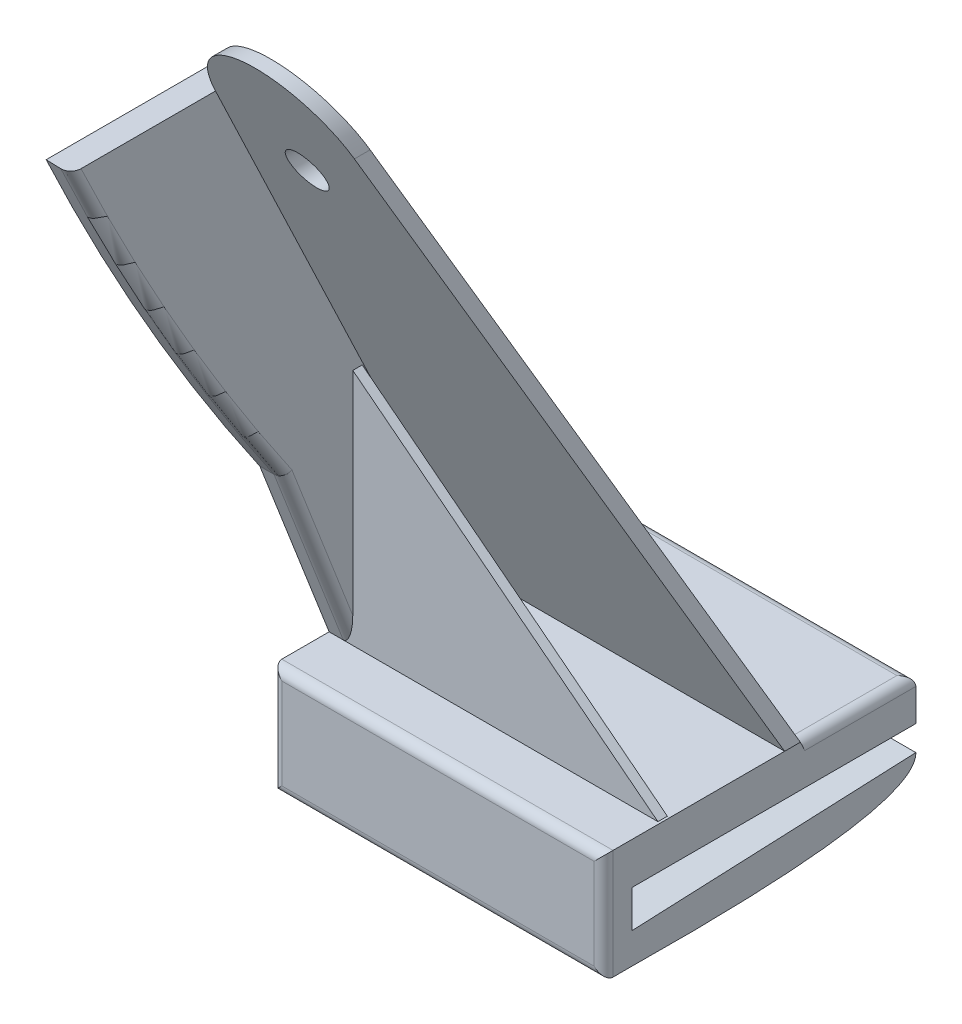
ISO-10303-21;
HEADER;
FILE_DESCRIPTION(('STEP AP214'),'2;1');
FILE_NAME('part.step','',(''),(''),'','','');
FILE_SCHEMA(('AUTOMOTIVE_DESIGN { 1 0 10303 214 1 1 1 1 }'));
ENDSEC;
DATA;
#1=APPLICATION_CONTEXT('core data for automotive mechanical design processes');
#2=APPLICATION_PROTOCOL_DEFINITION('international standard','automotive_design',2000,#1);
#3=PRODUCT_CONTEXT('',#1,'mechanical');
#4=PRODUCT('Part','Part','',(#3));
#5=PRODUCT_RELATED_PRODUCT_CATEGORY('part','',(#4));
#6=PRODUCT_DEFINITION_FORMATION('','',#4);
#7=PRODUCT_DEFINITION_CONTEXT('part definition',#1,'design');
#8=PRODUCT_DEFINITION('design','',#6,#7);
#9=PRODUCT_DEFINITION_SHAPE('','',#8);
#10=(LENGTH_UNIT() NAMED_UNIT(*) SI_UNIT(.MILLI.,.METRE.));
#11=(NAMED_UNIT(*) PLANE_ANGLE_UNIT() SI_UNIT($,.RADIAN.));
#12=(NAMED_UNIT(*) SI_UNIT($,.STERADIAN.) SOLID_ANGLE_UNIT());
#13=UNCERTAINTY_MEASURE_WITH_UNIT(LENGTH_MEASURE(1.E-05),#10,'distance_accuracy_value','');
#14=(GEOMETRIC_REPRESENTATION_CONTEXT(3) GLOBAL_UNCERTAINTY_ASSIGNED_CONTEXT((#13)) GLOBAL_UNIT_ASSIGNED_CONTEXT((#10,
#11,#12)) REPRESENTATION_CONTEXT('',''));
#15=CARTESIAN_POINT('',(0.,0.,0.));
#16=DIRECTION('',(0.,0.,1.));
#17=DIRECTION('',(1.,0.,0.));
#18=AXIS2_PLACEMENT_3D('',#15,#16,#17);
#19=CARTESIAN_POINT('',(0.,11.6,0.));
#20=DIRECTION('',(0.,1.,0.));
#21=DIRECTION('',(0.,0.,1.));
#22=AXIS2_PLACEMENT_3D('',#19,#20,#21);
#23=PLANE('',#22);
#24=DIRECTION('',(0.,0.,-1.));
#25=VECTOR('',#24,1.);
#26=CARTESIAN_POINT('',(35.,11.6,0.));
#27=LINE('',#26,#25);
#28=CARTESIAN_POINT('',(35.,11.6,2.));
#29=VERTEX_POINT('',#28);
#30=CARTESIAN_POINT('',(35.,11.6,-3.));
#31=VERTEX_POINT('',#30);
#32=EDGE_CURVE('E198',#29,#31,#27,.T.);
#33=ORIENTED_EDGE('',*,*,#32,.F.);
#34=DIRECTION('',(1.,0.,0.));
#35=VECTOR('',#34,1.);
#36=CARTESIAN_POINT('',(35.,11.6,2.));
#37=LINE('',#36,#35);
#38=CARTESIAN_POINT('',(70.,11.6,2.));
#39=VERTEX_POINT('',#38);
#40=EDGE_CURVE('E202',#39,#29,#37,.F.);
#41=ORIENTED_EDGE('',*,*,#40,.F.);
#42=DIRECTION('',(0.,0.,1.));
#43=VECTOR('',#42,1.);
#44=CARTESIAN_POINT('',(70.,11.6,0.));
#45=LINE('',#44,#43);
#46=CARTESIAN_POINT('',(70.,11.6,-16.1370091320722));
#47=VERTEX_POINT('',#46);
#48=EDGE_CURVE('E283',#47,#39,#45,.T.);
#49=ORIENTED_EDGE('',*,*,#48,.F.);
#50=DIRECTION('',(1.,0.,0.));
#51=VECTOR('',#50,1.);
#52=CARTESIAN_POINT('',(70.,11.6,-16.1370091320722));
#53=LINE('',#52,#51);
#54=CARTESIAN_POINT('',(37.5,11.6,-16.1370091320722));
#55=VERTEX_POINT('',#54);
#56=EDGE_CURVE('E294',#55,#47,#53,.T.);
#57=ORIENTED_EDGE('',*,*,#56,.F.);
#58=DIRECTION('',(0.,0.,1.));
#59=VECTOR('',#58,1.);
#60=CARTESIAN_POINT('',(37.5,11.6,0.));
#61=LINE('',#60,#59);
#62=CARTESIAN_POINT('',(37.5,11.6,-4.));
#63=VERTEX_POINT('',#62);
#64=EDGE_CURVE('E301',#55,#63,#61,.T.);
#65=ORIENTED_EDGE('',*,*,#64,.T.);
#66=DIRECTION('',(-1.,0.,0.));
#67=VECTOR('',#66,1.);
#68=CARTESIAN_POINT('',(70.,11.6,-4.));
#69=LINE('',#68,#67);
#70=CARTESIAN_POINT('',(69.7438487971098,11.6,-4.));
#71=VERTEX_POINT('',#70);
#72=EDGE_CURVE('E427',#71,#63,#69,.T.);
#73=ORIENTED_EDGE('',*,*,#72,.F.);
#74=DIRECTION('',(0.,0.,1.));
#75=VECTOR('',#74,1.);
#76=CARTESIAN_POINT('',(69.7438487971098,11.6,0.));
#77=LINE('',#76,#75);
#78=CARTESIAN_POINT('',(69.7438487971098,11.6,-3.));
#79=VERTEX_POINT('',#78);
#80=EDGE_CURVE('E430',#71,#79,#77,.T.);
#81=ORIENTED_EDGE('',*,*,#80,.T.);
#82=DIRECTION('',(-1.,0.,0.));
#83=VECTOR('',#82,1.);
#84=CARTESIAN_POINT('',(70.,11.6,-3.));
#85=LINE('',#84,#83);
#86=CARTESIAN_POINT('',(36.5,11.6,-3.));
#87=VERTEX_POINT('',#86);
#88=EDGE_CURVE('E425',#79,#87,#85,.T.);
#89=ORIENTED_EDGE('',*,*,#88,.T.);
#90=DIRECTION('',(-1.,0.,0.));
#91=VECTOR('',#90,1.);
#92=CARTESIAN_POINT('',(42.5,11.6,-3.));
#93=LINE('',#92,#91);
#94=EDGE_CURVE('E212',#87,#31,#93,.T.);
#95=ORIENTED_EDGE('',*,*,#94,.T.);
#96=EDGE_LOOP('',(#33,#41,#49,#57,#65,#73,#81,#89,#95));
#97=FACE_BOUND('',#96,.T.);
#98=ADVANCED_FACE('F34',(#97),#23,.T.);
#99=DIRECTION('',(0.,0.,-1.));
#100=VECTOR('',#99,1.);
#101=CARTESIAN_POINT('',(35.,11.6,0.));
#102=LINE('',#101,#100);
#103=CARTESIAN_POINT('',(35.,11.6,-17.7987012207227));
#104=VERTEX_POINT('',#103);
#105=CARTESIAN_POINT('',(35.,11.6,-29.));
#106=VERTEX_POINT('',#105);
#107=EDGE_CURVE('E495',#104,#106,#102,.T.);
#108=ORIENTED_EDGE('',*,*,#107,.F.);
#109=DIRECTION('',(1.,0.,0.));
#110=VECTOR('',#109,1.);
#111=CARTESIAN_POINT('',(-37.5,11.6,-17.7987012207227));
#112=LINE('',#111,#110);
#113=CARTESIAN_POINT('',(69.,11.6,-17.7987012207227));
#114=VERTEX_POINT('',#113);
#115=EDGE_CURVE('E480',#104,#114,#112,.T.);
#116=ORIENTED_EDGE('',*,*,#115,.T.);
#117=DIRECTION('',(0.,0.,1.));
#118=VECTOR('',#117,1.);
#119=CARTESIAN_POINT('',(69.,11.6,-17.7987012207227));
#120=LINE('',#119,#118);
#121=CARTESIAN_POINT('',(69.,11.6,-29.));
#122=VERTEX_POINT('',#121);
#123=EDGE_CURVE('E323',#122,#114,#120,.T.);
#124=ORIENTED_EDGE('',*,*,#123,.F.);
#125=DIRECTION('',(1.,0.,0.));
#126=VECTOR('',#125,1.);
#127=CARTESIAN_POINT('',(1.,11.6,-29.));
#128=LINE('',#127,#126);
#129=EDGE_CURVE('E11',#122,#106,#128,.F.);
#130=ORIENTED_EDGE('',*,*,#129,.T.);
#131=EDGE_LOOP('',(#108,#116,#124,#130));
#132=FACE_BOUND('',#131,.T.);
#133=ADVANCED_FACE('F377',(#132),#23,.T.);
#134=CARTESIAN_POINT('',(0.,0.,3.));
#135=DIRECTION('',(0.,1.,0.));
#136=DIRECTION('',(0.,0.,1.));
#137=AXIS2_PLACEMENT_3D('',#134,#135,#136);
#138=PLANE('',#137);
#139=DIRECTION('',(-1.,0.,0.));
#140=VECTOR('',#139,1.);
#141=CARTESIAN_POINT('',(70.,0.,2.));
#142=LINE('',#141,#140);
#143=CARTESIAN_POINT('',(35.,0.,2.));
#144=VERTEX_POINT('',#143);
#145=CARTESIAN_POINT('',(70.,0.,2.));
#146=VERTEX_POINT('',#145);
#147=EDGE_CURVE('E203',#144,#146,#142,.F.);
#148=ORIENTED_EDGE('',*,*,#147,.F.);
#149=DIRECTION('',(0.,0.,-1.));
#150=VECTOR('',#149,1.);
#151=CARTESIAN_POINT('',(35.,0.,3.));
#152=LINE('',#151,#150);
#153=CARTESIAN_POINT('',(35.,0.,0.));
#154=VERTEX_POINT('',#153);
#155=EDGE_CURVE('E51',#144,#154,#152,.T.);
#156=ORIENTED_EDGE('',*,*,#155,.T.);
#157=DIRECTION('',(1.,0.,0.));
#158=VECTOR('',#157,1.);
#159=CARTESIAN_POINT('',(0.,0.,0.));
#160=LINE('',#159,#158);
#161=CARTESIAN_POINT('',(70.,0.,0.));
#162=VERTEX_POINT('',#161);
#163=EDGE_CURVE('E353',#154,#162,#160,.T.);
#164=ORIENTED_EDGE('',*,*,#163,.T.);
#165=DIRECTION('',(0.,0.,-1.));
#166=VECTOR('',#165,1.);
#167=CARTESIAN_POINT('',(70.,0.,3.));
#168=LINE('',#167,#166);
#169=EDGE_CURVE('E292',#146,#162,#168,.T.);
#170=ORIENTED_EDGE('',*,*,#169,.F.);
#171=EDGE_LOOP('',(#148,#156,#164,#170));
#172=FACE_BOUND('',#171,.T.);
#173=ADVANCED_FACE('F351',(#172),#138,.F.);
#174=CARTESIAN_POINT('',(0.,0.,0.));
#175=DIRECTION('',(0.,0.,-1.));
#176=DIRECTION('',(-1.,0.,0.));
#177=AXIS2_PLACEMENT_3D('',#174,#175,#176);
#178=PLANE('',#177);
#179=DIRECTION('',(0.,-1.,0.));
#180=VECTOR('',#179,1.);
#181=CARTESIAN_POINT('',(35.,0.,0.));
#182=LINE('',#181,#180);
#183=CARTESIAN_POINT('',(35.,7.2,0.));
#184=VERTEX_POINT('',#183);
#185=CARTESIAN_POINT('',(35.,3.25,0.));
#186=VERTEX_POINT('',#185);
#187=EDGE_CURVE('E800',#184,#186,#182,.T.);
#188=ORIENTED_EDGE('',*,*,#187,.F.);
#189=DIRECTION('',(1.,0.,0.));
#190=VECTOR('',#189,1.);
#191=CARTESIAN_POINT('',(0.,7.2,0.));
#192=LINE('',#191,#190);
#193=CARTESIAN_POINT('',(70.,7.2,0.));
#194=VERTEX_POINT('',#193);
#195=EDGE_CURVE('E482',#184,#194,#192,.T.);
#196=ORIENTED_EDGE('',*,*,#195,.T.);
#197=DIRECTION('',(0.,-1.,0.));
#198=VECTOR('',#197,1.);
#199=CARTESIAN_POINT('',(70.,0.,0.));
#200=LINE('',#199,#198);
#201=CARTESIAN_POINT('',(70.,3.25,0.));
#202=VERTEX_POINT('',#201);
#203=EDGE_CURVE('E284',#194,#202,#200,.T.);
#204=ORIENTED_EDGE('',*,*,#203,.T.);
#205=DIRECTION('',(1.,0.,0.));
#206=VECTOR('',#205,1.);
#207=CARTESIAN_POINT('',(0.,3.25,0.));
#208=LINE('',#207,#206);
#209=EDGE_CURVE('E38',#186,#202,#208,.T.);
#210=ORIENTED_EDGE('',*,*,#209,.F.);
#211=EDGE_LOOP('',(#188,#196,#204,#210));
#212=FACE_BOUND('',#211,.T.);
#213=ADVANCED_FACE('F640',(#212),#178,.T.);
#214=CARTESIAN_POINT('',(0.,3.25,0.));
#215=DIRECTION('',(0.,0.999062431313918,0.0432927053569365));
#216=DIRECTION('',(0.,-0.0432927053569365,0.999062431313918));
#217=AXIS2_PLACEMENT_3D('',#214,#215,#216);
#218=PLANE('',#217);
#219=DIRECTION('',(0.,0.0432927053569365,-0.999062431313918));
#220=VECTOR('',#219,1.);
#221=CARTESIAN_POINT('',(35.,3.25,0.));
#222=LINE('',#221,#220);
#223=CARTESIAN_POINT('',(35.,4.55,-30.));
#224=VERTEX_POINT('',#223);
#225=EDGE_CURVE('E802',#186,#224,#222,.T.);
#226=ORIENTED_EDGE('',*,*,#225,.F.);
#227=ORIENTED_EDGE('',*,*,#209,.T.);
#228=DIRECTION('',(0.,-0.0432927053569365,0.999062431313918));
#229=VECTOR('',#228,1.);
#230=CARTESIAN_POINT('',(70.,3.25,0.));
#231=LINE('',#230,#229);
#232=CARTESIAN_POINT('',(70.,4.55,-30.));
#233=VERTEX_POINT('',#232);
#234=EDGE_CURVE('E279',#233,#202,#231,.T.);
#235=ORIENTED_EDGE('',*,*,#234,.F.);
#236=DIRECTION('',(-1.,0.,0.));
#237=VECTOR('',#236,1.);
#238=CARTESIAN_POINT('',(100.,4.55,-30.));
#239=LINE('',#238,#237);
#240=EDGE_CURVE('E462',#233,#224,#239,.T.);
#241=ORIENTED_EDGE('',*,*,#240,.T.);
#242=EDGE_LOOP('',(#226,#227,#235,#241));
#243=FACE_BOUND('',#242,.T.);
#244=ADVANCED_FACE('F397',(#243),#218,.T.);
#245=CARTESIAN_POINT('',(0.,7.2,0.));
#246=DIRECTION('',(0.,-1.,0.));
#247=DIRECTION('',(0.,0.,-1.));
#248=AXIS2_PLACEMENT_3D('',#245,#246,#247);
#249=PLANE('',#248);
#250=DIRECTION('',(0.,0.,1.));
#251=VECTOR('',#250,1.);
#252=CARTESIAN_POINT('',(35.,7.2,0.));
#253=LINE('',#252,#251);
#254=CARTESIAN_POINT('',(35.,7.2,-30.));
#255=VERTEX_POINT('',#254);
#256=EDGE_CURVE('E798',#255,#184,#253,.T.);
#257=ORIENTED_EDGE('',*,*,#256,.F.);
#258=DIRECTION('',(-1.,0.,0.));
#259=VECTOR('',#258,1.);
#260=CARTESIAN_POINT('',(0.,7.2,-30.));
#261=LINE('',#260,#259);
#262=CARTESIAN_POINT('',(70.,7.2,-30.));
#263=VERTEX_POINT('',#262);
#264=EDGE_CURVE('E466',#263,#255,#261,.T.);
#265=ORIENTED_EDGE('',*,*,#264,.F.);
#266=DIRECTION('',(0.,0.,-1.));
#267=VECTOR('',#266,1.);
#268=CARTESIAN_POINT('',(70.,7.2,0.));
#269=LINE('',#268,#267);
#270=EDGE_CURVE('E298',#194,#263,#269,.T.);
#271=ORIENTED_EDGE('',*,*,#270,.F.);
#272=ORIENTED_EDGE('',*,*,#195,.F.);
#273=EDGE_LOOP('',(#257,#265,#271,#272));
#274=FACE_BOUND('',#273,.T.);
#275=ADVANCED_FACE('F384',(#274),#249,.T.);
#276=CARTESIAN_POINT('',(-35.,186.497951372783,-222.090360411389));
#277=DIRECTION('',(1.,0.,0.));
#278=DIRECTION('',(0.,0.,-1.));
#279=AXIS2_PLACEMENT_3D('',#276,#277,#278);
#280=CYLINDRICAL_SURFACE('',#279,275.);
#281=CARTESIAN_POINT('',(-1762.6963471369,186.497951372783,-222.090360411389));
#282=DIRECTION('',(0.0648000197714473,0.997898270084491,0.));
#283=DIRECTION('',(-0.997898270084491,0.0648000197714473,0.));
#284=AXIS2_PLACEMENT_3D('',#281,#282,#283);
#285=ELLIPSE('',#284,4243.8258656392,275.);
#286=CARTESIAN_POINT('',(34.9999999999999,69.7618447677817,26.902975673547));
#287=VERTEX_POINT('',#286);
#288=CARTESIAN_POINT('',(36.5000000000006,69.6644400196514,26.8572859420116));
#289=VERTEX_POINT('',#288);
#290=EDGE_CURVE('E320',#287,#289,#285,.T.);
#291=ORIENTED_EDGE('',*,*,#290,.F.);
#292=CARTESIAN_POINT('',(35.,186.497951372783,-222.090360411389));
#293=DIRECTION('',(1.,0.,0.));
#294=DIRECTION('',(0.,0.,-1.));
#295=AXIS2_PLACEMENT_3D('',#292,#293,#294);
#296=CIRCLE('',#295,275.);
#297=CARTESIAN_POINT('',(35.,30.4120068557558,4.32116297959823));
#298=VERTEX_POINT('',#297);
#299=EDGE_CURVE('E402',#287,#298,#296,.T.);
#300=ORIENTED_EDGE('',*,*,#299,.T.);
#301=DIRECTION('',(1.,0.,0.));
#302=VECTOR('',#301,1.);
#303=CARTESIAN_POINT('',(-35.,30.4120068557558,4.32116297959823));
#304=LINE('',#303,#302);
#305=CARTESIAN_POINT('',(36.5,30.4120068557558,4.32116297959823));
#306=VERTEX_POINT('',#305);
#307=EDGE_CURVE('E486',#298,#306,#304,.T.);
#308=ORIENTED_EDGE('',*,*,#307,.T.);
#309=CARTESIAN_POINT('',(36.5,186.497951372783,-222.090360411389));
#310=DIRECTION('',(-1.,0.,0.));
#311=DIRECTION('',(0.,0.,1.));
#312=AXIS2_PLACEMENT_3D('',#309,#310,#311);
#313=CIRCLE('',#312,275.);
#314=EDGE_CURVE('E245',#289,#306,#313,.F.);
#315=ORIENTED_EDGE('',*,*,#314,.F.);
#316=EDGE_LOOP('',(#291,#300,#308,#315));
#317=FACE_BOUND('',#316,.T.);
#318=ADVANCED_FACE('F386',(#317),#280,.T.);
#319=CARTESIAN_POINT('',(-37.5000000000001,128.,37.6850598729848));
#320=DIRECTION('',(0.,-0.430282436917252,0.902694313973757));
#321=DIRECTION('',(0.,-0.902694313973757,-0.430282436917252));
#322=AXIS2_PLACEMENT_3D('',#319,#320,#321);
#323=PLANE('',#322);
#324=ORIENTED_EDGE('',*,*,#115,.F.);
#325=DIRECTION('',(0.,0.902694313973757,0.430282436917252));
#326=VECTOR('',#325,1.);
#327=CARTESIAN_POINT('',(35.,128.,37.6850598729848));
#328=LINE('',#327,#326);
#329=CARTESIAN_POINT('',(35.,69.5995035208979,9.84760974926996));
#330=VERTEX_POINT('',#329);
#331=EDGE_CURVE('E793',#104,#330,#328,.T.);
#332=ORIENTED_EDGE('',*,*,#331,.T.);
#333=DIRECTION('',(1.,0.,0.));
#334=VECTOR('',#333,1.);
#335=CARTESIAN_POINT('',(-107.529096293076,69.5995035208979,9.84760974926995));
#336=LINE('',#335,#334);
#337=CARTESIAN_POINT('',(37.5,69.5995035208979,9.84760974926995));
#338=VERTEX_POINT('',#337);
#339=EDGE_CURVE('E472',#330,#338,#336,.T.);
#340=ORIENTED_EDGE('',*,*,#339,.T.);
#341=CARTESIAN_POINT('',(45.5,69.5995035208995,9.84760974927068));
#342=DIRECTION('',(0.,0.430282436917252,-0.902694313973757));
#343=DIRECTION('',(0.,0.902694313973757,0.430282436917252));
#344=AXIS2_PLACEMENT_3D('',#341,#342,#343);
#345=ELLIPSE('',#344,8.86235780613609,7.99999999999999);
#346=CARTESIAN_POINT('',(53.205291343325,71.7508950042146,10.8731019406735));
#347=VERTEX_POINT('',#346);
#348=EDGE_CURVE('E412',#347,#338,#345,.F.);
#349=ORIENTED_EDGE('',*,*,#348,.F.);
#350=DIRECTION('',(-0.244397810333895,0.875320157626628,0.417234145242803));
#351=VECTOR('',#350,1.);
#352=CARTESIAN_POINT('',(41.6811202787203,113.025156909445,30.5470820684136));
#353=LINE('',#352,#351);
#354=CARTESIAN_POINT('',(70.,11.6,-17.7987012207227));
#355=VERTEX_POINT('',#354);
#356=EDGE_CURVE('E304',#355,#347,#353,.T.);
#357=ORIENTED_EDGE('',*,*,#356,.F.);
#358=DIRECTION('',(0.,-0.902694313973757,-0.430282436917252));
#359=VECTOR('',#358,1.);
#360=CARTESIAN_POINT('',(70.,10.2261550441347,-18.4535644965906));
#361=LINE('',#360,#359);
#362=CARTESIAN_POINT('',(70.,10.6,-18.2753658349298));
#363=VERTEX_POINT('',#362);
#364=EDGE_CURVE('E329',#355,#363,#361,.T.);
#365=ORIENTED_EDGE('',*,*,#364,.T.);
#366=CARTESIAN_POINT('',(69.,10.6,-18.2753658349298));
#367=DIRECTION('',(0.,0.430282436917252,-0.902694313973757));
#368=DIRECTION('',(0.,-0.902694313973757,-0.430282436917252));
#369=AXIS2_PLACEMENT_3D('',#366,#367,#368);
#370=ELLIPSE('',#369,1.10779472576701,1.);
#371=EDGE_CURVE('E332',#114,#363,#370,.T.);
#372=ORIENTED_EDGE('',*,*,#371,.F.);
#373=EDGE_LOOP('',(#324,#332,#340,#349,#357,#365,#372));
#374=FACE_BOUND('',#373,.T.);
#375=CARTESIAN_POINT('',(45.,65.,7.6551891779369));
#376=DIRECTION('',(0.,0.430282436917252,-0.902694313973757));
#377=DIRECTION('',(0.,0.902694313973757,0.430282436917252));
#378=AXIS2_PLACEMENT_3D('',#375,#376,#377);
#379=ELLIPSE('',#378,2.32636892411073,2.1);
#380=CARTESIAN_POINT('',(45.,67.1,8.65618486777183));
#381=VERTEX_POINT('',#380);
#382=EDGE_CURVE('E314',#381,#381,#379,.T.);
#383=ORIENTED_EDGE('',*,*,#382,.F.);
#384=EDGE_LOOP('',(#383));
#385=FACE_BOUND('',#384,.T.);
#386=ADVANCED_FACE('F388',(#374,#385),#323,.F.);
#387=CARTESIAN_POINT('',(42.5,11.6,-3.));
#388=DIRECTION('',(0.,0.362677863570311,-0.931914570803609));
#389=DIRECTION('',(0.,0.931914570803609,0.362677863570311));
#390=AXIS2_PLACEMENT_3D('',#387,#388,#389);
#391=PLANE('',#390);
#392=ORIENTED_EDGE('',*,*,#307,.F.);
#393=DIRECTION('',(0.,-0.931914570803609,-0.362677863570311));
#394=VECTOR('',#393,1.);
#395=CARTESIAN_POINT('',(35.,11.6,-3.));
#396=LINE('',#395,#394);
#397=EDGE_CURVE('E805',#298,#31,#396,.T.);
#398=ORIENTED_EDGE('',*,*,#397,.T.);
#399=ORIENTED_EDGE('',*,*,#94,.F.);
#400=DIRECTION('',(0.,-0.931914570803609,-0.362677863570311));
#401=VECTOR('',#400,1.);
#402=CARTESIAN_POINT('',(36.5,11.6,-3.));
#403=LINE('',#402,#401);
#404=EDGE_CURVE('E229',#306,#87,#403,.T.);
#405=ORIENTED_EDGE('',*,*,#404,.F.);
#406=EDGE_LOOP('',(#392,#398,#399,#405));
#407=FACE_BOUND('',#406,.T.);
#408=ADVANCED_FACE('F394',(#407),#391,.F.);
#409=CARTESIAN_POINT('',(-107.529096293076,69.5995035208979,9.84760974926995));
#410=DIRECTION('',(0.,-0.333510296636267,-0.94274645692126));
#411=DIRECTION('',(0.,0.94274645692126,-0.333510296636267));
#412=AXIS2_PLACEMENT_3D('',#409,#410,#411);
#413=PLANE('',#412);
#414=DIRECTION('',(0.,-0.94274645692126,0.333510296636267));
#415=VECTOR('',#414,1.);
#416=CARTESIAN_POINT('',(35.,69.5995035208979,9.84760974926995));
#417=LINE('',#416,#415);
#418=CARTESIAN_POINT('',(35.,69.7618447677817,9.7901791675828));
#419=VERTEX_POINT('',#418);
#420=EDGE_CURVE('E509',#419,#330,#417,.T.);
#421=ORIENTED_EDGE('',*,*,#420,.F.);
#422=DIRECTION('',(-0.997636171848008,0.0647830000296407,-0.0229179302645497));
#423=VECTOR('',#422,1.);
#424=CARTESIAN_POINT('',(37.2748466513844,69.6141241910397,9.84243747415803));
#425=LINE('',#424,#423);
#426=EDGE_CURVE('E278',#338,#419,#425,.T.);
#427=ORIENTED_EDGE('',*,*,#426,.F.);
#428=ORIENTED_EDGE('',*,*,#339,.F.);
#429=EDGE_LOOP('',(#421,#427,#428));
#430=FACE_BOUND('',#429,.T.);
#431=ADVANCED_FACE('F592',(#430),#413,.T.);
#432=CARTESIAN_POINT('',(100.,4.55,-30.));
#433=DIRECTION('',(0.,0.,1.));
#434=DIRECTION('',(1.,0.,0.));
#435=AXIS2_PLACEMENT_3D('',#432,#433,#434);
#436=PLANE('',#435);
#437=ORIENTED_EDGE('',*,*,#264,.T.);
#438=DIRECTION('',(0.,1.,0.));
#439=VECTOR('',#438,1.);
#440=CARTESIAN_POINT('',(35.,4.55,-30.));
#441=LINE('',#440,#439);
#442=CARTESIAN_POINT('',(35.,10.6,-30.));
#443=VERTEX_POINT('',#442);
#444=EDGE_CURVE('E493',#255,#443,#441,.T.);
#445=ORIENTED_EDGE('',*,*,#444,.T.);
#446=DIRECTION('',(1.,0.,0.));
#447=VECTOR('',#446,1.);
#448=CARTESIAN_POINT('',(35.,10.6,-30.));
#449=LINE('',#448,#447);
#450=CARTESIAN_POINT('',(70.,10.6,-30.));
#451=VERTEX_POINT('',#450);
#452=EDGE_CURVE('E44',#443,#451,#449,.T.);
#453=ORIENTED_EDGE('',*,*,#452,.T.);
#454=DIRECTION('',(0.,1.,0.));
#455=VECTOR('',#454,1.);
#456=CARTESIAN_POINT('',(70.,4.55,-30.));
#457=LINE('',#456,#455);
#458=EDGE_CURVE('E492',#263,#451,#457,.T.);
#459=ORIENTED_EDGE('',*,*,#458,.F.);
#460=EDGE_LOOP('',(#437,#445,#453,#459));
#461=FACE_BOUND('',#460,.T.);
#462=ADVANCED_FACE('F491',(#461),#436,.F.);
#463=CARTESIAN_POINT('',(100.,0.,0.));
#464=CARTESIAN_POINT('',(100.,-0.376378600084011,-30.0529531093992));
#465=CARTESIAN_POINT('',(100.,4.55,-30.));
#466=B_SPLINE_CURVE_WITH_KNOTS('',2,(#463,#464,#465),.UNSPECIFIED.,.F.,.F.,(3,3),(0.,1.),.UNSPECIFIED.);
#467=DIRECTION('',(-1.,0.,0.));
#468=VECTOR('',#467,1.);
#469=SURFACE_OF_LINEAR_EXTRUSION('',#466,#468);
#470=ORIENTED_EDGE('',*,*,#163,.F.);
#471=CARTESIAN_POINT('',(35.,0.,0.));
#472=CARTESIAN_POINT('',(35.,-0.376378600084011,-30.0529531093992));
#473=CARTESIAN_POINT('',(35.,4.55,-30.));
#474=B_SPLINE_CURVE_WITH_KNOTS('',2,(#471,#472,#473),.UNSPECIFIED.,.F.,.F.,(3,3),(0.,1.),.UNSPECIFIED.);
#475=EDGE_CURVE('E213',#154,#224,#474,.T.);
#476=ORIENTED_EDGE('',*,*,#475,.T.);
#477=ORIENTED_EDGE('',*,*,#240,.F.);
#478=CARTESIAN_POINT('',(70.,0.,0.));
#479=CARTESIAN_POINT('',(70.,-0.376378600084011,-30.0529531093992));
#480=CARTESIAN_POINT('',(70.,4.55,-30.));
#481=B_SPLINE_CURVE_WITH_KNOTS('',2,(#478,#479,#480),.UNSPECIFIED.,.F.,.F.,(3,3),(0.,1.),.UNSPECIFIED.);
#482=EDGE_CURVE('E506',#162,#233,#481,.T.);
#483=ORIENTED_EDGE('',*,*,#482,.F.);
#484=EDGE_LOOP('',(#470,#476,#477,#483));
#485=FACE_BOUND('',#484,.T.);
#486=ADVANCED_FACE('F573',(#485),#469,.F.);
#487=CARTESIAN_POINT('',(100.,10.6,-29.));
#488=DIRECTION('',(-1.,0.,0.));
#489=DIRECTION('',(0.,0.,1.));
#490=AXIS2_PLACEMENT_3D('',#487,#488,#489);
#491=CYLINDRICAL_SURFACE('',#490,1.);
#492=CARTESIAN_POINT('',(35.,10.6,-29.));
#493=DIRECTION('',(1.,0.,0.));
#494=DIRECTION('',(0.,0.,-1.));
#495=AXIS2_PLACEMENT_3D('',#492,#493,#494);
#496=CIRCLE('',#495,1.);
#497=EDGE_CURVE('E494',#106,#443,#496,.F.);
#498=ORIENTED_EDGE('',*,*,#497,.F.);
#499=ORIENTED_EDGE('',*,*,#129,.F.);
#500=CARTESIAN_POINT('',(69.,10.6,-29.));
#501=DIRECTION('',(0.707106781186547,0.,0.707106781186547));
#502=DIRECTION('',(0.707106781186547,0.,-0.707106781186547));
#503=AXIS2_PLACEMENT_3D('',#500,#501,#502);
#504=ELLIPSE('',#503,1.41421356237309,1.);
#505=EDGE_CURVE('E285',#122,#451,#504,.F.);
#506=ORIENTED_EDGE('',*,*,#505,.T.);
#507=ORIENTED_EDGE('',*,*,#452,.F.);
#508=EDGE_LOOP('',(#498,#499,#506,#507));
#509=FACE_BOUND('',#508,.T.);
#510=ADVANCED_FACE('F36',(#509),#491,.T.);
#511=CARTESIAN_POINT('',(37.5,69.5995035208979,0.));
#512=DIRECTION('',(-0.0648000197714473,-0.997898270084491,0.));
#513=DIRECTION('',(-0.997898270084491,0.0648000197714473,0.));
#514=AXIS2_PLACEMENT_3D('',#511,#512,#513);
#515=PLANE('',#514);
#516=ORIENTED_EDGE('',*,*,#426,.T.);
#517=DIRECTION('',(0.,0.,1.));
#518=VECTOR('',#517,1.);
#519=CARTESIAN_POINT('',(35.,69.7618447677817,3.));
#520=LINE('',#519,#518);
#521=EDGE_CURVE('E318',#419,#287,#520,.T.);
#522=ORIENTED_EDGE('',*,*,#521,.T.);
#523=ORIENTED_EDGE('',*,*,#290,.T.);
#524=CARTESIAN_POINT('',(37.5,69.5995035208979,25.7215700718309));
#525=CARTESIAN_POINT('',(37.5000190775314,69.5995022820698,25.7900385837331));
#526=CARTESIAN_POINT('',(37.4942490423444,69.5998769679526,25.8585045692338));
#527=CARTESIAN_POINT('',(37.4714187344544,69.6013594882124,25.9936344856225));
#528=CARTESIAN_POINT('',(37.4543399996963,69.6024685214508,26.0602952839014));
#529=CARTESIAN_POINT('',(37.4091621150759,69.6054022150991,26.189838792116));
#530=CARTESIAN_POINT('',(37.3810531766119,69.6072275111466,26.2527180888926));
#531=CARTESIAN_POINT('',(37.3143282182402,69.6115603963227,26.3725816654304));
#532=CARTESIAN_POINT('',(37.2757199229712,69.6140674838404,26.4295702367705));
#533=CARTESIAN_POINT('',(37.1903790307709,69.6196092225803,26.5335702053055));
#534=CARTESIAN_POINT('',(37.1440031898409,69.6226207073171,26.5808744656594));
#535=CARTESIAN_POINT('',(37.0432449764797,69.6291635929134,26.6660607935826));
#536=CARTESIAN_POINT('',(36.9888632054105,69.6326949547227,26.7039435682686));
#537=CARTESIAN_POINT('',(36.8790611433013,69.6398251161919,26.7652912220209));
#538=CARTESIAN_POINT('',(36.8242014504821,69.6433875125663,26.7897651082781));
#539=CARTESIAN_POINT('',(36.7109393100086,69.65074235941,26.8279381357866));
#540=CARTESIAN_POINT('',(36.6525472425864,69.6545341358234,26.8416673384864));
#541=CARTESIAN_POINT('',(36.5779714671366,69.6593768255729,26.8516826110144));
#542=CARTESIAN_POINT('',(36.5624084482409,69.66038743353,26.8533662599938));
#543=CARTESIAN_POINT('',(36.5312367943581,69.6624116115935,26.8559285792759));
#544=CARTESIAN_POINT('',(36.5156282442096,69.6634251761908,26.8568082860898));
#545=CARTESIAN_POINT('',(36.5,69.6644400196514,26.8572859420115));
#546=B_SPLINE_CURVE_WITH_KNOTS('',3,(#524,#525,#526,#527,#528,#529,#530,#531,#532,#533,#534,
#535,#536,#537,#538,#539,#540,#541,#542,#543,#544,#545),.UNSPECIFIED.,.F.,.F.,(4,2,2,2,2,2,2,2,
2,2,4),(0.,0.205165865480211,0.410667503724113,0.61635192549021,0.821885427599768,
1.01975245137075,1.21760462002066,1.39716917414621,1.57622952893574,1.62327551534842,
1.67026076010732),.UNSPECIFIED.);
#547=CARTESIAN_POINT('',(37.5,69.5995035208979,25.7215700718309));
#548=VERTEX_POINT('',#547);
#549=EDGE_CURVE('E248',#548,#289,#546,.T.);
#550=ORIENTED_EDGE('',*,*,#549,.F.);
#551=DIRECTION('',(0.,0.,1.));
#552=VECTOR('',#551,1.);
#553=CARTESIAN_POINT('',(37.5,69.5995035208979,0.));
#554=LINE('',#553,#552);
#555=CARTESIAN_POINT('',(37.5,69.5995035208979,11.5093018379205));
#556=VERTEX_POINT('',#555);
#557=EDGE_CURVE('E223',#556,#548,#554,.T.);
#558=ORIENTED_EDGE('',*,*,#557,.F.);
#559=EDGE_CURVE('E515',#338,#556,#554,.T.);
#560=ORIENTED_EDGE('',*,*,#559,.F.);
#561=EDGE_LOOP('',(#516,#522,#523,#550,#558,#560));
#562=FACE_BOUND('',#561,.T.);
#563=ADVANCED_FACE('F258',(#562),#515,.F.);
#564=CARTESIAN_POINT('',(70.,0.,3.));
#565=DIRECTION('',(0.,0.,-1.));
#566=DIRECTION('',(1.,0.,0.));
#567=AXIS2_PLACEMENT_3D('',#564,#565,#566);
#568=PLANE('',#567);
#569=DIRECTION('',(1.,0.,0.));
#570=VECTOR('',#569,1.);
#571=CARTESIAN_POINT('',(70.,10.6,3.));
#572=LINE('',#571,#570);
#573=CARTESIAN_POINT('',(36.,10.6,3.));
#574=VERTEX_POINT('',#573);
#575=CARTESIAN_POINT('',(69.,10.6,3.));
#576=VERTEX_POINT('',#575);
#577=EDGE_CURVE('E334',#574,#576,#572,.T.);
#578=ORIENTED_EDGE('',*,*,#577,.F.);
#579=DIRECTION('',(0.,1.,0.));
#580=VECTOR('',#579,1.);
#581=CARTESIAN_POINT('',(36.,0.,3.));
#582=LINE('',#581,#580);
#583=CARTESIAN_POINT('',(36.,1.,3.));
#584=VERTEX_POINT('',#583);
#585=EDGE_CURVE('E219',#584,#574,#582,.T.);
#586=ORIENTED_EDGE('',*,*,#585,.F.);
#587=DIRECTION('',(-1.,0.,0.));
#588=VECTOR('',#587,1.);
#589=CARTESIAN_POINT('',(70.,1.,3.));
#590=LINE('',#589,#588);
#591=CARTESIAN_POINT('',(69.,1.,3.));
#592=VERTEX_POINT('',#591);
#593=EDGE_CURVE('E337',#592,#584,#590,.T.);
#594=ORIENTED_EDGE('',*,*,#593,.F.);
#595=DIRECTION('',(0.,-1.,0.));
#596=VECTOR('',#595,1.);
#597=CARTESIAN_POINT('',(69.,0.,3.));
#598=LINE('',#597,#596);
#599=EDGE_CURVE('E340',#576,#592,#598,.T.);
#600=ORIENTED_EDGE('',*,*,#599,.F.);
#601=EDGE_LOOP('',(#578,#586,#594,#600));
#602=FACE_BOUND('',#601,.T.);
#603=ADVANCED_FACE('F364',(#602),#568,.F.);
#604=CARTESIAN_POINT('',(37.5,128.,105.));
#605=DIRECTION('',(1.,0.,0.));
#606=DIRECTION('',(0.,0.,1.));
#607=AXIS2_PLACEMENT_3D('',#604,#605,#606);
#608=PLANE('',#607);
#609=DIRECTION('',(0.,1.,0.));
#610=VECTOR('',#609,1.);
#611=CARTESIAN_POINT('',(37.5,128.,-3.));
#612=LINE('',#611,#610);
#613=CARTESIAN_POINT('',(37.5,14.3572678137995,-3.));
#614=VERTEX_POINT('',#613);
#615=CARTESIAN_POINT('',(37.5,36.7756372277729,-3.));
#616=VERTEX_POINT('',#615);
#617=EDGE_CURVE('E307',#614,#616,#612,.T.);
#618=ORIENTED_EDGE('',*,*,#617,.T.);
#619=DIRECTION('',(0.,0.,1.));
#620=VECTOR('',#619,1.);
#621=CARTESIAN_POINT('',(37.5,36.7756372277729,-4.));
#622=LINE('',#621,#620);
#623=CARTESIAN_POINT('',(37.5,36.7756372277729,-4.));
#624=VERTEX_POINT('',#623);
#625=EDGE_CURVE('E421',#624,#616,#622,.T.);
#626=ORIENTED_EDGE('',*,*,#625,.F.);
#627=DIRECTION('',(0.,1.,0.));
#628=VECTOR('',#627,1.);
#629=CARTESIAN_POINT('',(37.5,128.,-4.));
#630=LINE('',#629,#628);
#631=EDGE_CURVE('E310',#63,#624,#630,.T.);
#632=ORIENTED_EDGE('',*,*,#631,.F.);
#633=ORIENTED_EDGE('',*,*,#64,.F.);
#634=DIRECTION('',(0.,0.902694313973756,0.430282436917252));
#635=VECTOR('',#634,1.);
#636=CARTESIAN_POINT('',(37.5000000000001,128.,39.3467519616354));
#637=LINE('',#636,#635);
#638=EDGE_CURVE('E438',#55,#556,#637,.T.);
#639=ORIENTED_EDGE('',*,*,#638,.T.);
#640=ORIENTED_EDGE('',*,*,#557,.T.);
#641=CARTESIAN_POINT('',(37.5,186.497951372783,-222.090360411389));
#642=DIRECTION('',(-1.,0.,0.));
#643=DIRECTION('',(0.,0.,1.));
#644=AXIS2_PLACEMENT_3D('',#641,#642,#643);
#645=CIRCLE('',#644,274.);
#646=CARTESIAN_POINT('',(37.5,30.8835778877866,3.43162690885454));
#647=VERTEX_POINT('',#646);
#648=EDGE_CURVE('E232',#647,#548,#645,.T.);
#649=ORIENTED_EDGE('',*,*,#648,.F.);
#650=DIRECTION('',(0.,-0.931914570803609,-0.362677863570311));
#651=VECTOR('',#650,1.);
#652=CARTESIAN_POINT('',(37.5,30.7746847193261,3.38924840879462));
#653=LINE('',#652,#651);
#654=EDGE_CURVE('E242',#614,#647,#653,.F.);
#655=ORIENTED_EDGE('',*,*,#654,.F.);
#656=EDGE_LOOP('',(#618,#626,#632,#633,#639,#640,#649,#655));
#657=FACE_BOUND('',#656,.T.);
#658=ADVANCED_FACE('F366',(#657),#608,.T.);
#659=CARTESIAN_POINT('',(70.,0.,3.));
#660=DIRECTION('',(-1.,0.,0.));
#661=DIRECTION('',(0.,0.,-1.));
#662=AXIS2_PLACEMENT_3D('',#659,#660,#661);
#663=PLANE('',#662);
#664=DIRECTION('',(0.,0.,1.));
#665=VECTOR('',#664,1.);
#666=CARTESIAN_POINT('',(70.,10.6,-44.));
#667=LINE('',#666,#665);
#668=EDGE_CURVE('E326',#363,#451,#667,.F.);
#669=ORIENTED_EDGE('',*,*,#668,.F.);
#670=ORIENTED_EDGE('',*,*,#364,.F.);
#671=DIRECTION('',(0.,0.,-1.));
#672=VECTOR('',#671,1.);
#673=CARTESIAN_POINT('',(70.,11.6,105.));
#674=LINE('',#673,#672);
#675=EDGE_CURVE('E433',#47,#355,#674,.T.);
#676=ORIENTED_EDGE('',*,*,#675,.F.);
#677=ORIENTED_EDGE('',*,*,#48,.T.);
#678=DIRECTION('',(0.,-1.,0.));
#679=VECTOR('',#678,1.);
#680=CARTESIAN_POINT('',(70.,0.,2.));
#681=LINE('',#680,#679);
#682=EDGE_CURVE('E343',#146,#39,#681,.F.);
#683=ORIENTED_EDGE('',*,*,#682,.F.);
#684=ORIENTED_EDGE('',*,*,#169,.T.);
#685=ORIENTED_EDGE('',*,*,#482,.T.);
#686=ORIENTED_EDGE('',*,*,#234,.T.);
#687=ORIENTED_EDGE('',*,*,#203,.F.);
#688=ORIENTED_EDGE('',*,*,#270,.T.);
#689=ORIENTED_EDGE('',*,*,#458,.T.);
#690=EDGE_LOOP('',(#669,#670,#676,#677,#683,#684,#685,#686,#687,#688,#689));
#691=FACE_BOUND('',#690,.T.);
#692=ADVANCED_FACE('F358',(#691),#663,.F.);
#693=CARTESIAN_POINT('',(107.5,128.,39.3467519616354));
#694=DIRECTION('',(0.,0.430282436917252,-0.902694313973756));
#695=DIRECTION('',(0.,0.902694313973756,0.430282436917252));
#696=AXIS2_PLACEMENT_3D('',#693,#694,#695);
#697=PLANE('',#696);
#698=CARTESIAN_POINT('',(45.,65.,9.31688126658744));
#699=DIRECTION('',(0.,-0.430282436917252,0.902694313973756));
#700=DIRECTION('',(0.,0.902694313973756,0.430282436917252));
#701=AXIS2_PLACEMENT_3D('',#698,#699,#700);
#702=ELLIPSE('',#701,2.32636892411073,2.1);
#703=CARTESIAN_POINT('',(45.,67.1,10.3178769564224));
#704=VERTEX_POINT('',#703);
#705=EDGE_CURVE('E317',#704,#704,#702,.T.);
#706=ORIENTED_EDGE('',*,*,#705,.F.);
#707=EDGE_LOOP('',(#706));
#708=FACE_BOUND('',#707,.T.);
#709=ORIENTED_EDGE('',*,*,#638,.F.);
#710=ORIENTED_EDGE('',*,*,#56,.T.);
#711=DIRECTION('',(0.244397810333895,-0.875320157626628,-0.417234145242803));
#712=VECTOR('',#711,1.);
#713=CARTESIAN_POINT('',(41.6811202787203,113.025156909445,32.2087741570641));
#714=LINE('',#713,#712);
#715=CARTESIAN_POINT('',(53.205291343325,71.7508950042146,12.5347940293241));
#716=VERTEX_POINT('',#715);
#717=EDGE_CURVE('E436',#716,#47,#714,.T.);
#718=ORIENTED_EDGE('',*,*,#717,.F.);
#719=CARTESIAN_POINT('',(45.5,69.5995035208995,11.5093018379212));
#720=DIRECTION('',(0.,-0.430282436917252,0.902694313973756));
#721=DIRECTION('',(0.,0.902694313973756,0.430282436917252));
#722=AXIS2_PLACEMENT_3D('',#719,#720,#721);
#723=ELLIPSE('',#722,8.8623578061361,7.99999999999999);
#724=EDGE_CURVE('E409',#556,#716,#723,.F.);
#725=ORIENTED_EDGE('',*,*,#724,.F.);
#726=EDGE_LOOP('',(#709,#710,#718,#725));
#727=FACE_BOUND('',#726,.T.);
#728=ADVANCED_FACE('F444',(#708,#727),#697,.F.);
#729=CARTESIAN_POINT('',(37.5000000000001,128.,105.));
#730=DIRECTION('',(-0.963161417915574,-0.268923935414571,0.));
#731=DIRECTION('',(-0.268923935414571,0.963161417915574,0.));
#732=AXIS2_PLACEMENT_3D('',#729,#730,#731);
#733=PLANE('',#732);
#734=ORIENTED_EDGE('',*,*,#717,.T.);
#735=ORIENTED_EDGE('',*,*,#675,.T.);
#736=ORIENTED_EDGE('',*,*,#356,.T.);
#737=DIRECTION('',(0.,0.,-1.));
#738=VECTOR('',#737,1.);
#739=CARTESIAN_POINT('',(53.205291343325,71.7508950042146,105.));
#740=LINE('',#739,#738);
#741=EDGE_CURVE('E313',#716,#347,#740,.T.);
#742=ORIENTED_EDGE('',*,*,#741,.F.);
#743=EDGE_LOOP('',(#734,#735,#736,#742));
#744=FACE_BOUND('',#743,.T.);
#745=ADVANCED_FACE('F735',(#744),#733,.F.);
#746=CARTESIAN_POINT('',(37.5,36.7756372277729,-4.));
#747=DIRECTION('',(0.615418296825304,0.788200685062277,0.));
#748=DIRECTION('',(0.788200685062277,-0.615418296825304,0.));
#749=AXIS2_PLACEMENT_3D('',#746,#747,#748);
#750=PLANE('',#749);
#751=DIRECTION('',(0.788200685062277,-0.615418296825304,0.));
#752=VECTOR('',#751,1.);
#753=CARTESIAN_POINT('',(37.5,36.7756372277729,-4.));
#754=LINE('',#753,#752);
#755=EDGE_CURVE('E419',#624,#71,#754,.T.);
#756=ORIENTED_EDGE('',*,*,#755,.F.);
#757=ORIENTED_EDGE('',*,*,#625,.T.);
#758=DIRECTION('',(0.788200685062277,-0.615418296825304,0.));
#759=VECTOR('',#758,1.);
#760=CARTESIAN_POINT('',(37.5,36.7756372277729,-3.));
#761=LINE('',#760,#759);
#762=EDGE_CURVE('E418',#616,#79,#761,.T.);
#763=ORIENTED_EDGE('',*,*,#762,.T.);
#764=ORIENTED_EDGE('',*,*,#80,.F.);
#765=EDGE_LOOP('',(#756,#757,#763,#764));
#766=FACE_BOUND('',#765,.T.);
#767=ADVANCED_FACE('F454',(#766),#750,.T.);
#768=CARTESIAN_POINT('',(70.,0.,-4.));
#769=DIRECTION('',(0.,0.,1.));
#770=DIRECTION('',(-1.,0.,0.));
#771=AXIS2_PLACEMENT_3D('',#768,#769,#770);
#772=PLANE('',#771);
#773=ORIENTED_EDGE('',*,*,#72,.T.);
#774=ORIENTED_EDGE('',*,*,#631,.T.);
#775=ORIENTED_EDGE('',*,*,#755,.T.);
#776=EDGE_LOOP('',(#773,#774,#775));
#777=FACE_BOUND('',#776,.T.);
#778=ADVANCED_FACE('F451',(#777),#772,.F.);
#779=CARTESIAN_POINT('',(70.,0.,-3.));
#780=DIRECTION('',(0.,0.,1.));
#781=DIRECTION('',(-1.,0.,0.));
#782=AXIS2_PLACEMENT_3D('',#779,#780,#781);
#783=PLANE('',#782);
#784=ORIENTED_EDGE('',*,*,#762,.F.);
#785=ORIENTED_EDGE('',*,*,#617,.F.);
#786=CARTESIAN_POINT('',(36.5,14.3572678137995,-3.));
#787=DIRECTION('',(0.,0.,-1.));
#788=DIRECTION('',(0.,1.,0.));
#789=AXIS2_PLACEMENT_3D('',#786,#787,#788);
#790=ELLIPSE('',#789,2.75726781379954,1.);
#791=EDGE_CURVE('E256',#87,#614,#790,.F.);
#792=ORIENTED_EDGE('',*,*,#791,.F.);
#793=ORIENTED_EDGE('',*,*,#88,.F.);
#794=EDGE_LOOP('',(#784,#785,#792,#793));
#795=FACE_BOUND('',#794,.T.);
#796=ADVANCED_FACE('F458',(#795),#783,.T.);
#797=CARTESIAN_POINT('',(45.,65.,0.));
#798=DIRECTION('',(0.,0.,1.));
#799=DIRECTION('',(-1.,0.,0.));
#800=AXIS2_PLACEMENT_3D('',#797,#798,#799);
#801=CYLINDRICAL_SURFACE('',#800,2.1);
#802=ORIENTED_EDGE('',*,*,#382,.T.);
#803=EDGE_LOOP('',(#802));
#804=FACE_BOUND('',#803,.T.);
#805=ORIENTED_EDGE('',*,*,#705,.T.);
#806=EDGE_LOOP('',(#805));
#807=FACE_BOUND('',#806,.T.);
#808=ADVANCED_FACE('F702',(#804,#807),#801,.F.);
#809=CARTESIAN_POINT('',(45.5,69.5995035208995,0.));
#810=DIRECTION('',(0.,0.,1.));
#811=DIRECTION('',(-1.,0.,0.));
#812=AXIS2_PLACEMENT_3D('',#809,#810,#811);
#813=CYLINDRICAL_SURFACE('',#812,7.99999999999999);
#814=ORIENTED_EDGE('',*,*,#559,.T.);
#815=ORIENTED_EDGE('',*,*,#724,.T.);
#816=ORIENTED_EDGE('',*,*,#741,.T.);
#817=ORIENTED_EDGE('',*,*,#348,.T.);
#818=EDGE_LOOP('',(#814,#815,#816,#817));
#819=FACE_BOUND('',#818,.T.);
#820=ADVANCED_FACE('F520',(#819),#813,.T.);
#821=CARTESIAN_POINT('',(69.,10.6,0.));
#822=DIRECTION('',(0.,0.,-1.));
#823=DIRECTION('',(1.,0.,0.));
#824=AXIS2_PLACEMENT_3D('',#821,#822,#823);
#825=CYLINDRICAL_SURFACE('',#824,1.);
#826=ORIENTED_EDGE('',*,*,#123,.T.);
#827=ORIENTED_EDGE('',*,*,#371,.T.);
#828=ORIENTED_EDGE('',*,*,#668,.T.);
#829=ORIENTED_EDGE('',*,*,#505,.F.);
#830=EDGE_LOOP('',(#826,#827,#828,#829));
#831=FACE_BOUND('',#830,.T.);
#832=ADVANCED_FACE('F502',(#831),#825,.T.);
#833=CARTESIAN_POINT('',(36.,0.,2.));
#834=DIRECTION('',(0.,1.,0.));
#835=DIRECTION('',(0.,0.,1.));
#836=AXIS2_PLACEMENT_3D('',#833,#834,#835);
#837=CYLINDRICAL_SURFACE('',#836,1.);
#838=CARTESIAN_POINT('',(36.,1.,2.));
#839=DIRECTION('',(0.707106781186547,-0.707106781186547,0.));
#840=DIRECTION('',(0.707106781186547,0.707106781186547,0.));
#841=AXIS2_PLACEMENT_3D('',#838,#839,#840);
#842=ELLIPSE('',#841,1.41421356237309,1.);
#843=EDGE_CURVE('E224',#144,#584,#842,.F.);
#844=ORIENTED_EDGE('',*,*,#843,.T.);
#845=ORIENTED_EDGE('',*,*,#585,.T.);
#846=CARTESIAN_POINT('',(36.,10.6,2.));
#847=DIRECTION('',(0.707106781186547,0.707106781186547,0.));
#848=DIRECTION('',(-0.707106781186547,0.707106781186547,0.));
#849=AXIS2_PLACEMENT_3D('',#846,#847,#848);
#850=ELLIPSE('',#849,1.41421356237309,1.);
#851=EDGE_CURVE('E216',#574,#29,#850,.F.);
#852=ORIENTED_EDGE('',*,*,#851,.T.);
#853=DIRECTION('',(0.,1.,0.));
#854=VECTOR('',#853,1.);
#855=CARTESIAN_POINT('',(35.,12.,2.));
#856=LINE('',#855,#854);
#857=EDGE_CURVE('E195',#29,#144,#856,.F.);
#858=ORIENTED_EDGE('',*,*,#857,.T.);
#859=EDGE_LOOP('',(#844,#845,#852,#858));
#860=FACE_BOUND('',#859,.T.);
#861=ADVANCED_FACE('F217',(#860),#837,.T.);
#862=CARTESIAN_POINT('',(70.,10.6,2.));
#863=DIRECTION('',(-1.,0.,0.));
#864=DIRECTION('',(0.,0.,-1.));
#865=AXIS2_PLACEMENT_3D('',#862,#863,#864);
#866=CYLINDRICAL_SURFACE('',#865,1.);
#867=ORIENTED_EDGE('',*,*,#851,.F.);
#868=ORIENTED_EDGE('',*,*,#577,.T.);
#869=CARTESIAN_POINT('',(69.,10.6,2.));
#870=DIRECTION('',(0.707106781186547,-0.707106781186547,0.));
#871=DIRECTION('',(-0.707106781186547,-0.707106781186547,0.));
#872=AXIS2_PLACEMENT_3D('',#869,#870,#871);
#873=ELLIPSE('',#872,1.41421356237309,1.);
#874=EDGE_CURVE('E227',#576,#39,#873,.F.);
#875=ORIENTED_EDGE('',*,*,#874,.T.);
#876=ORIENTED_EDGE('',*,*,#40,.T.);
#877=EDGE_LOOP('',(#867,#868,#875,#876));
#878=FACE_BOUND('',#877,.T.);
#879=ADVANCED_FACE('F226',(#878),#866,.T.);
#880=CARTESIAN_POINT('',(70.,1.,2.));
#881=DIRECTION('',(-1.,0.,0.));
#882=DIRECTION('',(0.,0.,-1.));
#883=AXIS2_PLACEMENT_3D('',#880,#881,#882);
#884=CYLINDRICAL_SURFACE('',#883,1.);
#885=ORIENTED_EDGE('',*,*,#843,.F.);
#886=ORIENTED_EDGE('',*,*,#147,.T.);
#887=CARTESIAN_POINT('',(69.,1.,2.));
#888=DIRECTION('',(0.707106781186547,0.707106781186547,0.));
#889=DIRECTION('',(-0.707106781186547,0.707106781186547,0.));
#890=AXIS2_PLACEMENT_3D('',#887,#888,#889);
#891=ELLIPSE('',#890,1.41421356237309,1.);
#892=EDGE_CURVE('E236',#146,#592,#891,.F.);
#893=ORIENTED_EDGE('',*,*,#892,.T.);
#894=ORIENTED_EDGE('',*,*,#593,.T.);
#895=EDGE_LOOP('',(#885,#886,#893,#894));
#896=FACE_BOUND('',#895,.T.);
#897=ADVANCED_FACE('F348',(#896),#884,.T.);
#898=CARTESIAN_POINT('',(69.,0.,2.));
#899=DIRECTION('',(0.,-1.,0.));
#900=DIRECTION('',(0.,0.,-1.));
#901=AXIS2_PLACEMENT_3D('',#898,#899,#900);
#902=CYLINDRICAL_SURFACE('',#901,1.);
#903=ORIENTED_EDGE('',*,*,#874,.F.);
#904=ORIENTED_EDGE('',*,*,#599,.T.);
#905=ORIENTED_EDGE('',*,*,#892,.F.);
#906=ORIENTED_EDGE('',*,*,#682,.T.);
#907=EDGE_LOOP('',(#903,#904,#905,#906));
#908=FACE_BOUND('',#907,.T.);
#909=ADVANCED_FACE('F268',(#908),#902,.T.);
#910=CARTESIAN_POINT('',(36.5,186.497951372783,-222.090360411389));
#911=DIRECTION('',(1.,0.,0.));
#912=DIRECTION('',(0.,0.,1.));
#913=AXIS2_PLACEMENT_3D('',#910,#911,#912);
#914=TOROIDAL_SURFACE('',#913,274.,1.);
#915=ORIENTED_EDGE('',*,*,#549,.T.);
#916=ORIENTED_EDGE('',*,*,#314,.T.);
#917=CARTESIAN_POINT('',(36.5,30.4120068557558,4.32116297959823));
#918=CARTESIAN_POINT('',(36.5279958959158,30.4120068977515,4.32116290343598));
#919=CARTESIAN_POINT('',(36.5559783308477,30.4125614943542,4.32011648193836));
#920=CARTESIAN_POINT('',(36.6117419192088,30.4147736962152,4.31594248498056));
#921=CARTESIAN_POINT('',(36.639523084871,30.4164312338594,4.31281503709458));
#922=CARTESIAN_POINT('',(36.7222105026426,30.4230413905395,4.30034301926954));
#923=CARTESIAN_POINT('',(36.7765611414079,30.4296316033723,4.28790868055551));
#924=CARTESIAN_POINT('',(36.882123768931,30.4469889100129,4.25515969033565));
#925=CARTESIAN_POINT('',(36.933334460266,30.4577577171209,4.23484180643218));
#926=CARTESIAN_POINT('',(37.0311816228153,30.4831562385765,4.18692268697523));
#927=CARTESIAN_POINT('',(37.0778189139273,30.4977852591411,4.1593227601986));
#928=CARTESIAN_POINT('',(37.165353276327,30.5305299819435,4.09754657916053));
#929=CARTESIAN_POINT('',(37.2062331709843,30.5486557504808,4.06335133863694));
#930=CARTESIAN_POINT('',(37.2809788878687,30.5878537003106,3.98940486201621));
#931=CARTESIAN_POINT('',(37.314842342916,30.6089268719833,3.94965175837927));
#932=CARTESIAN_POINT('',(37.3748146267565,30.6535627426956,3.86545248104069));
#933=CARTESIAN_POINT('',(37.4008705628848,30.6771410185549,3.82097694429831));
#934=CARTESIAN_POINT('',(37.4442005158998,30.7259971267311,3.72882386528116));
#935=CARTESIAN_POINT('',(37.4614811437077,30.7512736633508,3.68114876416185));
#936=CARTESIAN_POINT('',(37.4822479702933,30.7934958087302,3.60151530979552));
#937=CARTESIAN_POINT('',(37.4884613336163,30.8101592707108,3.5700878822625));
#938=CARTESIAN_POINT('',(37.4970575119573,30.8436853417307,3.5068591897244));
#939=CARTESIAN_POINT('',(37.4994464497765,30.8605475888249,3.47505860453746));
#940=CARTESIAN_POINT('',(37.4999715640609,30.8794659879716,3.43938130387357));
#941=CARTESIAN_POINT('',(37.5000000750068,30.8815220391342,3.43550390882591));
#942=CARTESIAN_POINT('',(37.5,30.8835778877867,3.43162690885466));
#943=B_SPLINE_CURVE_WITH_KNOTS('',3,(#917,#918,#919,#920,#921,#922,#923,#924,#925,#926,#927,
#928,#929,#930,#931,#932,#933,#934,#935,#936,#937,#938,#939,#940,#941,#942),.UNSPECIFIED.,.F.,
.F.,(4,2,2,2,2,2,2,2,2,2,2,2,4),(0.,0.0839359354927457,0.167866725892729,0.335430757286353,
0.503063565721185,0.670666266579156,0.838758856251412,1.0069080643511,1.1761719164135,
1.34530806285003,1.4534620602788,1.56144273231894,1.57460896527972),.UNSPECIFIED.);
#944=EDGE_CURVE('E238',#306,#647,#943,.T.);
#945=ORIENTED_EDGE('',*,*,#944,.T.);
#946=ORIENTED_EDGE('',*,*,#648,.T.);
#947=EDGE_LOOP('',(#915,#916,#945,#946));
#948=FACE_BOUND('',#947,.T.);
#949=ADVANCED_FACE('F262',(#948),#914,.T.);
#950=CARTESIAN_POINT('',(36.5,11.9626778635703,-3.93191457080361));
#951=DIRECTION('',(0.,0.931914570803609,0.362677863570311));
#952=DIRECTION('',(0.,-0.362677863570311,0.931914570803609));
#953=AXIS2_PLACEMENT_3D('',#950,#951,#952);
#954=CYLINDRICAL_SURFACE('',#953,1.);
#955=ORIENTED_EDGE('',*,*,#944,.F.);
#956=ORIENTED_EDGE('',*,*,#404,.T.);
#957=ORIENTED_EDGE('',*,*,#791,.T.);
#958=ORIENTED_EDGE('',*,*,#654,.T.);
#959=EDGE_LOOP('',(#955,#956,#957,#958));
#960=FACE_BOUND('',#959,.T.);
#961=ADVANCED_FACE('F267',(#960),#954,.T.);
#962=CARTESIAN_POINT('',(35.,-88.4,200.));
#963=DIRECTION('',(1.,0.,0.));
#964=DIRECTION('',(0.,0.,-1.));
#965=AXIS2_PLACEMENT_3D('',#962,#963,#964);
#966=PLANE('',#965);
#967=ORIENTED_EDGE('',*,*,#420,.T.);
#968=ORIENTED_EDGE('',*,*,#331,.F.);
#969=ORIENTED_EDGE('',*,*,#107,.T.);
#970=ORIENTED_EDGE('',*,*,#497,.T.);
#971=ORIENTED_EDGE('',*,*,#444,.F.);
#972=ORIENTED_EDGE('',*,*,#256,.T.);
#973=ORIENTED_EDGE('',*,*,#187,.T.);
#974=ORIENTED_EDGE('',*,*,#225,.T.);
#975=ORIENTED_EDGE('',*,*,#475,.F.);
#976=ORIENTED_EDGE('',*,*,#155,.F.);
#977=ORIENTED_EDGE('',*,*,#857,.F.);
#978=ORIENTED_EDGE('',*,*,#32,.T.);
#979=ORIENTED_EDGE('',*,*,#397,.F.);
#980=ORIENTED_EDGE('',*,*,#299,.F.);
#981=ORIENTED_EDGE('',*,*,#521,.F.);
#982=EDGE_LOOP('',(#967,#968,#969,#970,#971,#972,#973,#974,#975,#976,#977,#978,#979,#980,#981));
#983=FACE_BOUND('',#982,.T.);
#984=ADVANCED_FACE('F197',(#983),#966,.F.);
#985=CLOSED_SHELL('',(#98,#133,#173,#213,#244,#275,#318,#386,#408,#431,#462,#486,#510,#563,#603,
#658,#692,#728,#745,#767,#778,#796,#808,#820,#832,#861,#879,#897,#909,#949,#961,#984));
#986=MANIFOLD_SOLID_BREP('B2',#985);
#987=ADVANCED_BREP_SHAPE_REPRESENTATION('',(#18,#986),#14);
#988=SHAPE_DEFINITION_REPRESENTATION(#9,#987);
ENDSEC;
END-ISO-10303-21;
